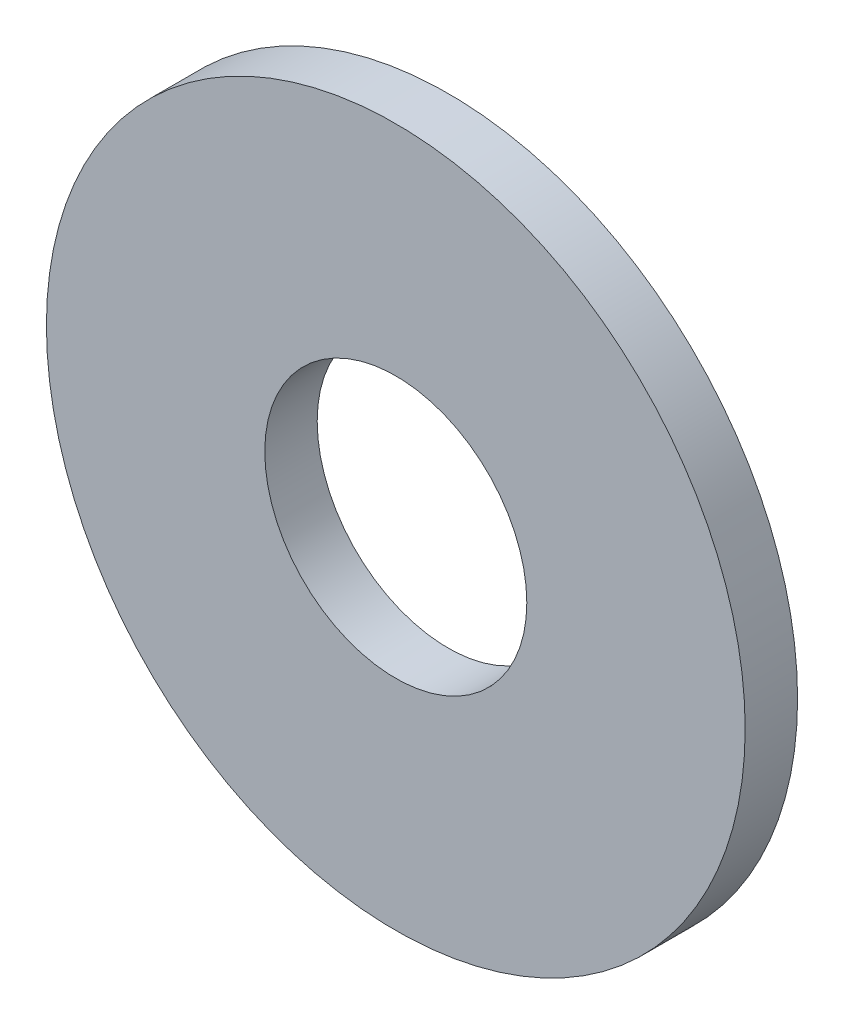
ISO-10303-21;
HEADER;
FILE_DESCRIPTION(('STEP AP214'),'2;1');
FILE_NAME('part.step','',(''),(''),'','','');
FILE_SCHEMA(('AUTOMOTIVE_DESIGN { 1 0 10303 214 1 1 1 1 }'));
ENDSEC;
DATA;
#1=APPLICATION_CONTEXT('core data for automotive mechanical design processes');
#2=APPLICATION_PROTOCOL_DEFINITION('international standard','automotive_design',2000,#1);
#3=PRODUCT_CONTEXT('',#1,'mechanical');
#4=PRODUCT('Part','Part','',(#3));
#5=PRODUCT_RELATED_PRODUCT_CATEGORY('part','',(#4));
#6=PRODUCT_DEFINITION_FORMATION('','',#4);
#7=PRODUCT_DEFINITION_CONTEXT('part definition',#1,'design');
#8=PRODUCT_DEFINITION('design','',#6,#7);
#9=PRODUCT_DEFINITION_SHAPE('','',#8);
#10=(LENGTH_UNIT() NAMED_UNIT(*) SI_UNIT(.MILLI.,.METRE.));
#11=(NAMED_UNIT(*) PLANE_ANGLE_UNIT() SI_UNIT($,.RADIAN.));
#12=(NAMED_UNIT(*) SI_UNIT($,.STERADIAN.) SOLID_ANGLE_UNIT());
#13=UNCERTAINTY_MEASURE_WITH_UNIT(LENGTH_MEASURE(1.E-05),#10,'distance_accuracy_value','');
#14=(GEOMETRIC_REPRESENTATION_CONTEXT(3) GLOBAL_UNCERTAINTY_ASSIGNED_CONTEXT((#13)) GLOBAL_UNIT_ASSIGNED_CONTEXT((#10,
#11,#12)) REPRESENTATION_CONTEXT('',''));
#15=CARTESIAN_POINT('',(0.,0.,0.));
#16=DIRECTION('',(0.,0.,1.));
#17=DIRECTION('',(1.,0.,0.));
#18=AXIS2_PLACEMENT_3D('',#15,#16,#17);
#19=CARTESIAN_POINT('',(0.,0.,0.6));
#20=DIRECTION('',(0.,0.,1.));
#21=DIRECTION('',(1.,0.,0.));
#22=AXIS2_PLACEMENT_3D('',#19,#20,#21);
#23=PLANE('',#22);
#24=CARTESIAN_POINT('',(0.,0.,0.6));
#25=DIRECTION('',(0.,0.,1.));
#26=DIRECTION('',(1.,0.,0.));
#27=AXIS2_PLACEMENT_3D('',#24,#25,#26);
#28=CIRCLE('',#27,4.);
#29=CARTESIAN_POINT('',(4.,0.,0.6));
#30=VERTEX_POINT('',#29);
#31=EDGE_CURVE('E10',#30,#30,#28,.T.);
#32=ORIENTED_EDGE('',*,*,#31,.T.);
#33=EDGE_LOOP('',(#32));
#34=FACE_BOUND('',#33,.T.);
#35=CARTESIAN_POINT('',(0.,0.,0.6));
#36=DIRECTION('',(0.,0.,1.));
#37=DIRECTION('',(1.,0.,0.));
#38=AXIS2_PLACEMENT_3D('',#35,#36,#37);
#39=CIRCLE('',#38,1.5);
#40=CARTESIAN_POINT('',(1.5,0.,0.6));
#41=VERTEX_POINT('',#40);
#42=EDGE_CURVE('E44',#41,#41,#39,.T.);
#43=ORIENTED_EDGE('',*,*,#42,.F.);
#44=EDGE_LOOP('',(#43));
#45=FACE_BOUND('',#44,.T.);
#46=ADVANCED_FACE('F33',(#34,#45),#23,.T.);
#47=CARTESIAN_POINT('',(0.,0.,0.));
#48=DIRECTION('',(0.,0.,1.));
#49=DIRECTION('',(1.,0.,0.));
#50=AXIS2_PLACEMENT_3D('',#47,#48,#49);
#51=PLANE('',#50);
#52=CARTESIAN_POINT('',(0.,0.,0.));
#53=DIRECTION('',(0.,0.,1.));
#54=DIRECTION('',(1.,0.,0.));
#55=AXIS2_PLACEMENT_3D('',#52,#53,#54);
#56=CIRCLE('',#55,4.);
#57=CARTESIAN_POINT('',(4.,0.,0.));
#58=VERTEX_POINT('',#57);
#59=EDGE_CURVE('E37',#58,#58,#56,.T.);
#60=ORIENTED_EDGE('',*,*,#59,.F.);
#61=EDGE_LOOP('',(#60));
#62=FACE_BOUND('',#61,.T.);
#63=CARTESIAN_POINT('',(0.,0.,0.));
#64=DIRECTION('',(0.,0.,1.));
#65=DIRECTION('',(1.,0.,0.));
#66=AXIS2_PLACEMENT_3D('',#63,#64,#65);
#67=CIRCLE('',#66,1.5);
#68=CARTESIAN_POINT('',(1.5,0.,0.));
#69=VERTEX_POINT('',#68);
#70=EDGE_CURVE('E46',#69,#69,#67,.T.);
#71=ORIENTED_EDGE('',*,*,#70,.T.);
#72=EDGE_LOOP('',(#71));
#73=FACE_BOUND('',#72,.T.);
#74=ADVANCED_FACE('F56',(#62,#73),#51,.F.);
#75=CARTESIAN_POINT('',(0.,0.,0.6));
#76=DIRECTION('',(0.,0.,-1.));
#77=DIRECTION('',(-1.,0.,0.));
#78=AXIS2_PLACEMENT_3D('',#75,#76,#77);
#79=CYLINDRICAL_SURFACE('',#78,4.);
#80=ORIENTED_EDGE('',*,*,#31,.F.);
#81=EDGE_LOOP('',(#80));
#82=FACE_BOUND('',#81,.T.);
#83=ORIENTED_EDGE('',*,*,#59,.T.);
#84=EDGE_LOOP('',(#83));
#85=FACE_BOUND('',#84,.T.);
#86=ADVANCED_FACE('F35',(#82,#85),#79,.T.);
#87=CARTESIAN_POINT('',(0.,0.,0.6));
#88=DIRECTION('',(0.,0.,-1.));
#89=DIRECTION('',(-1.,0.,0.));
#90=AXIS2_PLACEMENT_3D('',#87,#88,#89);
#91=CYLINDRICAL_SURFACE('',#90,1.5);
#92=ORIENTED_EDGE('',*,*,#42,.T.);
#93=EDGE_LOOP('',(#92));
#94=FACE_BOUND('',#93,.T.);
#95=ORIENTED_EDGE('',*,*,#70,.F.);
#96=EDGE_LOOP('',(#95));
#97=FACE_BOUND('',#96,.T.);
#98=ADVANCED_FACE('F52',(#94,#97),#91,.F.);
#99=CLOSED_SHELL('',(#46,#74,#86,#98));
#100=MANIFOLD_SOLID_BREP('B2',#99);
#101=ADVANCED_BREP_SHAPE_REPRESENTATION('',(#18,#100),#14);
#102=SHAPE_DEFINITION_REPRESENTATION(#9,#101);
ENDSEC;
END-ISO-10303-21;
